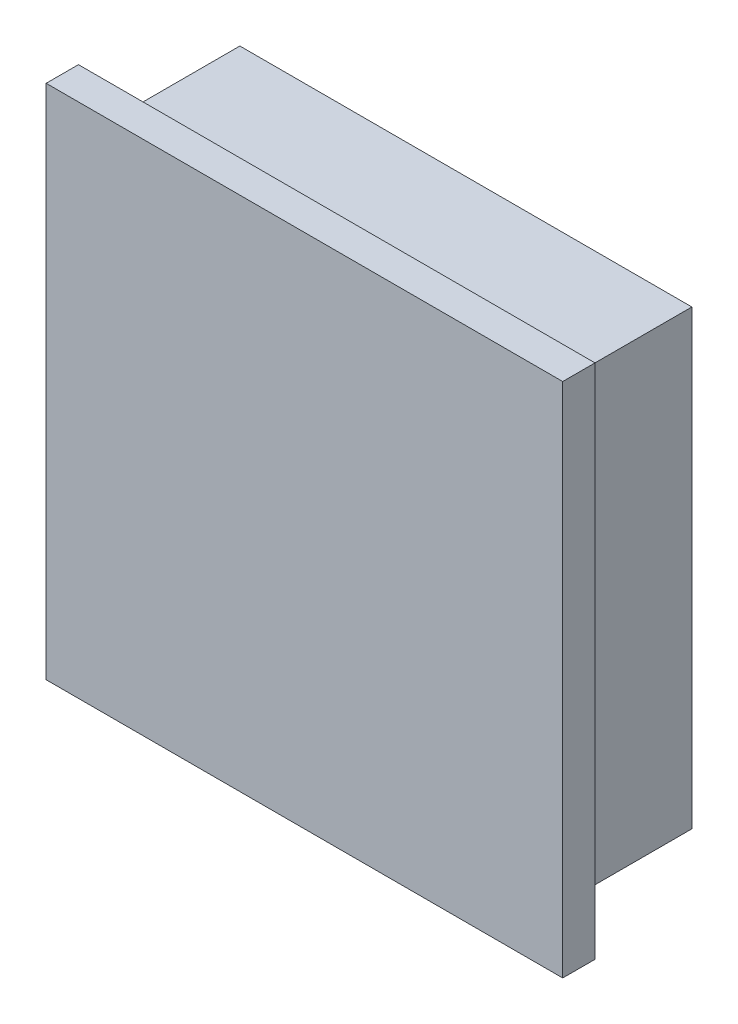
ISO-10303-21;
HEADER;
FILE_DESCRIPTION(('STEP AP214'),'2;1');
FILE_NAME('part.step','',(''),(''),'','','');
FILE_SCHEMA(('AUTOMOTIVE_DESIGN { 1 0 10303 214 1 1 1 1 }'));
ENDSEC;
DATA;
#1=APPLICATION_CONTEXT('core data for automotive mechanical design processes');
#2=APPLICATION_PROTOCOL_DEFINITION('international standard','automotive_design',2000,#1);
#3=PRODUCT_CONTEXT('',#1,'mechanical');
#4=PRODUCT('Part','Part','',(#3));
#5=PRODUCT_RELATED_PRODUCT_CATEGORY('part','',(#4));
#6=PRODUCT_DEFINITION_FORMATION('','',#4);
#7=PRODUCT_DEFINITION_CONTEXT('part definition',#1,'design');
#8=PRODUCT_DEFINITION('design','',#6,#7);
#9=PRODUCT_DEFINITION_SHAPE('','',#8);
#10=(LENGTH_UNIT() NAMED_UNIT(*) SI_UNIT(.MILLI.,.METRE.));
#11=(NAMED_UNIT(*) PLANE_ANGLE_UNIT() SI_UNIT($,.RADIAN.));
#12=(NAMED_UNIT(*) SI_UNIT($,.STERADIAN.) SOLID_ANGLE_UNIT());
#13=UNCERTAINTY_MEASURE_WITH_UNIT(LENGTH_MEASURE(1.E-05),#10,'distance_accuracy_value','');
#14=(GEOMETRIC_REPRESENTATION_CONTEXT(3) GLOBAL_UNCERTAINTY_ASSIGNED_CONTEXT((#13)) GLOBAL_UNIT_ASSIGNED_CONTEXT((#10,
#11,#12)) REPRESENTATION_CONTEXT('',''));
#15=CARTESIAN_POINT('',(0.,0.,0.));
#16=DIRECTION('',(0.,0.,1.));
#17=DIRECTION('',(1.,0.,0.));
#18=AXIS2_PLACEMENT_3D('',#15,#16,#17);
#19=CARTESIAN_POINT('',(0.,-3.175,3.175));
#20=DIRECTION('',(0.,1.,0.));
#21=DIRECTION('',(0.,0.,1.));
#22=AXIS2_PLACEMENT_3D('',#19,#20,#21);
#23=PLANE('',#22);
#24=DIRECTION('',(1.,0.,0.));
#25=VECTOR('',#24,1.);
#26=CARTESIAN_POINT('',(0.,-3.175,0.));
#27=LINE('',#26,#25);
#28=CARTESIAN_POINT('',(-3.175,-3.175,0.));
#29=VERTEX_POINT('',#28);
#30=CARTESIAN_POINT('',(47.625,-3.175,0.));
#31=VERTEX_POINT('',#30);
#32=EDGE_CURVE('E148',#29,#31,#27,.T.);
#33=ORIENTED_EDGE('',*,*,#32,.T.);
#34=DIRECTION('',(0.,0.,-1.));
#35=VECTOR('',#34,1.);
#36=CARTESIAN_POINT('',(47.625,-3.175,3.175));
#37=LINE('',#36,#35);
#38=CARTESIAN_POINT('',(47.625,-3.175,3.175));
#39=VERTEX_POINT('',#38);
#40=EDGE_CURVE('E11',#39,#31,#37,.T.);
#41=ORIENTED_EDGE('',*,*,#40,.F.);
#42=DIRECTION('',(1.,0.,0.));
#43=VECTOR('',#42,1.);
#44=CARTESIAN_POINT('',(0.,-3.175,3.175));
#45=LINE('',#44,#43);
#46=CARTESIAN_POINT('',(-3.175,-3.175,3.175));
#47=VERTEX_POINT('',#46);
#48=EDGE_CURVE('E155',#47,#39,#45,.T.);
#49=ORIENTED_EDGE('',*,*,#48,.F.);
#50=DIRECTION('',(0.,0.,-1.));
#51=VECTOR('',#50,1.);
#52=CARTESIAN_POINT('',(-3.175,-3.175,3.175));
#53=LINE('',#52,#51);
#54=EDGE_CURVE('E171',#47,#29,#53,.T.);
#55=ORIENTED_EDGE('',*,*,#54,.T.);
#56=EDGE_LOOP('',(#33,#41,#49,#55));
#57=FACE_BOUND('',#56,.T.);
#58=ADVANCED_FACE('F41',(#57),#23,.F.);
#59=CARTESIAN_POINT('',(47.625,0.,3.175));
#60=DIRECTION('',(-1.,0.,0.));
#61=DIRECTION('',(0.,0.,1.));
#62=AXIS2_PLACEMENT_3D('',#59,#60,#61);
#63=PLANE('',#62);
#64=DIRECTION('',(0.,1.,0.));
#65=VECTOR('',#64,1.);
#66=CARTESIAN_POINT('',(47.625,0.,0.));
#67=LINE('',#66,#65);
#68=CARTESIAN_POINT('',(47.625,47.625,0.));
#69=VERTEX_POINT('',#68);
#70=EDGE_CURVE('E175',#31,#69,#67,.T.);
#71=ORIENTED_EDGE('',*,*,#70,.T.);
#72=DIRECTION('',(0.,0.,-1.));
#73=VECTOR('',#72,1.);
#74=CARTESIAN_POINT('',(47.625,47.625,3.175));
#75=LINE('',#74,#73);
#76=CARTESIAN_POINT('',(47.625,47.625,3.175));
#77=VERTEX_POINT('',#76);
#78=EDGE_CURVE('E49',#77,#69,#75,.T.);
#79=ORIENTED_EDGE('',*,*,#78,.F.);
#80=DIRECTION('',(0.,1.,0.));
#81=VECTOR('',#80,1.);
#82=CARTESIAN_POINT('',(47.625,0.,3.175));
#83=LINE('',#82,#81);
#84=EDGE_CURVE('E159',#39,#77,#83,.T.);
#85=ORIENTED_EDGE('',*,*,#84,.F.);
#86=ORIENTED_EDGE('',*,*,#40,.T.);
#87=EDGE_LOOP('',(#71,#79,#85,#86));
#88=FACE_BOUND('',#87,.T.);
#89=ADVANCED_FACE('F197',(#88),#63,.F.);
#90=CARTESIAN_POINT('',(0.,47.625,3.175));
#91=DIRECTION('',(0.,1.,0.));
#92=DIRECTION('',(0.,0.,1.));
#93=AXIS2_PLACEMENT_3D('',#90,#91,#92);
#94=PLANE('',#93);
#95=DIRECTION('',(1.,0.,0.));
#96=VECTOR('',#95,1.);
#97=CARTESIAN_POINT('',(0.,47.625,0.));
#98=LINE('',#97,#96);
#99=CARTESIAN_POINT('',(-3.175,47.625,0.));
#100=VERTEX_POINT('',#99);
#101=EDGE_CURVE('E179',#100,#69,#98,.T.);
#102=ORIENTED_EDGE('',*,*,#101,.F.);
#103=DIRECTION('',(0.,0.,-1.));
#104=VECTOR('',#103,1.);
#105=CARTESIAN_POINT('',(-3.175,47.625,3.175));
#106=LINE('',#105,#104);
#107=CARTESIAN_POINT('',(-3.175,47.625,3.175));
#108=VERTEX_POINT('',#107);
#109=EDGE_CURVE('E188',#108,#100,#106,.T.);
#110=ORIENTED_EDGE('',*,*,#109,.F.);
#111=DIRECTION('',(1.,0.,0.));
#112=VECTOR('',#111,1.);
#113=CARTESIAN_POINT('',(0.,47.625,3.175));
#114=LINE('',#113,#112);
#115=EDGE_CURVE('E163',#108,#77,#114,.T.);
#116=ORIENTED_EDGE('',*,*,#115,.T.);
#117=ORIENTED_EDGE('',*,*,#78,.T.);
#118=EDGE_LOOP('',(#102,#110,#116,#117));
#119=FACE_BOUND('',#118,.T.);
#120=ADVANCED_FACE('F194',(#119),#94,.T.);
#121=CARTESIAN_POINT('',(-3.175,0.,3.175));
#122=DIRECTION('',(-1.,0.,0.));
#123=DIRECTION('',(0.,0.,1.));
#124=AXIS2_PLACEMENT_3D('',#121,#122,#123);
#125=PLANE('',#124);
#126=DIRECTION('',(0.,1.,0.));
#127=VECTOR('',#126,1.);
#128=CARTESIAN_POINT('',(-3.175,0.,0.));
#129=LINE('',#128,#127);
#130=EDGE_CURVE('E160',#29,#100,#129,.T.);
#131=ORIENTED_EDGE('',*,*,#130,.F.);
#132=ORIENTED_EDGE('',*,*,#54,.F.);
#133=DIRECTION('',(0.,1.,0.));
#134=VECTOR('',#133,1.);
#135=CARTESIAN_POINT('',(-3.175,0.,3.175));
#136=LINE('',#135,#134);
#137=EDGE_CURVE('E167',#47,#108,#136,.T.);
#138=ORIENTED_EDGE('',*,*,#137,.T.);
#139=ORIENTED_EDGE('',*,*,#109,.T.);
#140=EDGE_LOOP('',(#131,#132,#138,#139));
#141=FACE_BOUND('',#140,.T.);
#142=ADVANCED_FACE('F204',(#141),#125,.T.);
#143=CARTESIAN_POINT('',(0.,0.,3.175));
#144=DIRECTION('',(0.,0.,1.));
#145=DIRECTION('',(1.,0.,0.));
#146=AXIS2_PLACEMENT_3D('',#143,#144,#145);
#147=PLANE('',#146);
#148=ORIENTED_EDGE('',*,*,#48,.T.);
#149=ORIENTED_EDGE('',*,*,#84,.T.);
#150=ORIENTED_EDGE('',*,*,#115,.F.);
#151=ORIENTED_EDGE('',*,*,#137,.F.);
#152=EDGE_LOOP('',(#148,#149,#150,#151));
#153=FACE_BOUND('',#152,.T.);
#154=ADVANCED_FACE('F208',(#153),#147,.T.);
#155=CARTESIAN_POINT('',(0.,0.,0.));
#156=DIRECTION('',(0.,0.,1.));
#157=DIRECTION('',(1.,0.,0.));
#158=AXIS2_PLACEMENT_3D('',#155,#156,#157);
#159=PLANE('',#158);
#160=DIRECTION('',(0.,1.,0.));
#161=VECTOR('',#160,1.);
#162=CARTESIAN_POINT('',(0.,0.,0.));
#163=LINE('',#162,#161);
#164=CARTESIAN_POINT('',(0.,0.,0.));
#165=VERTEX_POINT('',#164);
#166=CARTESIAN_POINT('',(0.,44.45,0.));
#167=VERTEX_POINT('',#166);
#168=EDGE_CURVE('E128',#165,#167,#163,.T.);
#169=ORIENTED_EDGE('',*,*,#168,.F.);
#170=DIRECTION('',(1.,0.,0.));
#171=VECTOR('',#170,1.);
#172=CARTESIAN_POINT('',(0.,0.,0.));
#173=LINE('',#172,#171);
#174=CARTESIAN_POINT('',(44.45,0.,0.));
#175=VERTEX_POINT('',#174);
#176=EDGE_CURVE('E56',#165,#175,#173,.T.);
#177=ORIENTED_EDGE('',*,*,#176,.T.);
#178=DIRECTION('',(0.,1.,0.));
#179=VECTOR('',#178,1.);
#180=CARTESIAN_POINT('',(44.45,0.,0.));
#181=LINE('',#180,#179);
#182=CARTESIAN_POINT('',(44.45,44.45,0.));
#183=VERTEX_POINT('',#182);
#184=EDGE_CURVE('E61',#175,#183,#181,.T.);
#185=ORIENTED_EDGE('',*,*,#184,.T.);
#186=DIRECTION('',(1.,0.,0.));
#187=VECTOR('',#186,1.);
#188=CARTESIAN_POINT('',(0.,44.45,0.));
#189=LINE('',#188,#187);
#190=EDGE_CURVE('E132',#167,#183,#189,.T.);
#191=ORIENTED_EDGE('',*,*,#190,.F.);
#192=EDGE_LOOP('',(#169,#177,#185,#191));
#193=FACE_BOUND('',#192,.T.);
#194=ORIENTED_EDGE('',*,*,#32,.F.);
#195=ORIENTED_EDGE('',*,*,#130,.T.);
#196=ORIENTED_EDGE('',*,*,#101,.T.);
#197=ORIENTED_EDGE('',*,*,#70,.F.);
#198=EDGE_LOOP('',(#194,#195,#196,#197));
#199=FACE_BOUND('',#198,.T.);
#200=ADVANCED_FACE('F201',(#193,#199),#159,.F.);
#201=CARTESIAN_POINT('',(0.,0.,-12.7));
#202=DIRECTION('',(0.,-1.,0.));
#203=DIRECTION('',(0.,0.,-1.));
#204=AXIS2_PLACEMENT_3D('',#201,#202,#203);
#205=PLANE('',#204);
#206=ORIENTED_EDGE('',*,*,#176,.F.);
#207=DIRECTION('',(0.,0.,1.));
#208=VECTOR('',#207,1.);
#209=CARTESIAN_POINT('',(0.,0.,-12.7));
#210=LINE('',#209,#208);
#211=CARTESIAN_POINT('',(0.,0.,-12.7));
#212=VERTEX_POINT('',#211);
#213=EDGE_CURVE('E125',#212,#165,#210,.T.);
#214=ORIENTED_EDGE('',*,*,#213,.F.);
#215=DIRECTION('',(1.,0.,0.));
#216=VECTOR('',#215,1.);
#217=CARTESIAN_POINT('',(0.,0.,-12.7));
#218=LINE('',#217,#216);
#219=CARTESIAN_POINT('',(44.45,0.,-12.7));
#220=VERTEX_POINT('',#219);
#221=EDGE_CURVE('E117',#212,#220,#218,.T.);
#222=ORIENTED_EDGE('',*,*,#221,.T.);
#223=DIRECTION('',(0.,0.,1.));
#224=VECTOR('',#223,1.);
#225=CARTESIAN_POINT('',(44.45,0.,-12.7));
#226=LINE('',#225,#224);
#227=EDGE_CURVE('E104',#220,#175,#226,.T.);
#228=ORIENTED_EDGE('',*,*,#227,.T.);
#229=EDGE_LOOP('',(#206,#214,#222,#228));
#230=FACE_BOUND('',#229,.T.);
#231=ADVANCED_FACE('F123',(#230),#205,.T.);
#232=CARTESIAN_POINT('',(0.,0.,-12.7));
#233=DIRECTION('',(1.,0.,0.));
#234=DIRECTION('',(0.,0.,-1.));
#235=AXIS2_PLACEMENT_3D('',#232,#233,#234);
#236=PLANE('',#235);
#237=ORIENTED_EDGE('',*,*,#168,.T.);
#238=DIRECTION('',(0.,0.,1.));
#239=VECTOR('',#238,1.);
#240=CARTESIAN_POINT('',(0.,44.45,-12.7));
#241=LINE('',#240,#239);
#242=CARTESIAN_POINT('',(0.,44.45,-12.7));
#243=VERTEX_POINT('',#242);
#244=EDGE_CURVE('E149',#243,#167,#241,.T.);
#245=ORIENTED_EDGE('',*,*,#244,.F.);
#246=DIRECTION('',(0.,1.,0.));
#247=VECTOR('',#246,1.);
#248=CARTESIAN_POINT('',(0.,0.,-12.7));
#249=LINE('',#248,#247);
#250=EDGE_CURVE('E112',#212,#243,#249,.T.);
#251=ORIENTED_EDGE('',*,*,#250,.F.);
#252=ORIENTED_EDGE('',*,*,#213,.T.);
#253=EDGE_LOOP('',(#237,#245,#251,#252));
#254=FACE_BOUND('',#253,.T.);
#255=ADVANCED_FACE('F227',(#254),#236,.F.);
#256=CARTESIAN_POINT('',(0.,44.45,-12.7));
#257=DIRECTION('',(0.,-1.,0.));
#258=DIRECTION('',(0.,0.,-1.));
#259=AXIS2_PLACEMENT_3D('',#256,#257,#258);
#260=PLANE('',#259);
#261=ORIENTED_EDGE('',*,*,#190,.T.);
#262=DIRECTION('',(0.,0.,1.));
#263=VECTOR('',#262,1.);
#264=CARTESIAN_POINT('',(44.45,44.45,-12.7));
#265=LINE('',#264,#263);
#266=CARTESIAN_POINT('',(44.45,44.45,-12.7));
#267=VERTEX_POINT('',#266);
#268=EDGE_CURVE('E111',#267,#183,#265,.T.);
#269=ORIENTED_EDGE('',*,*,#268,.F.);
#270=DIRECTION('',(1.,0.,0.));
#271=VECTOR('',#270,1.);
#272=CARTESIAN_POINT('',(0.,44.45,-12.7));
#273=LINE('',#272,#271);
#274=EDGE_CURVE('E119',#243,#267,#273,.T.);
#275=ORIENTED_EDGE('',*,*,#274,.F.);
#276=ORIENTED_EDGE('',*,*,#244,.T.);
#277=EDGE_LOOP('',(#261,#269,#275,#276));
#278=FACE_BOUND('',#277,.T.);
#279=ADVANCED_FACE('F230',(#278),#260,.F.);
#280=CARTESIAN_POINT('',(44.45,0.,-12.7));
#281=DIRECTION('',(1.,0.,0.));
#282=DIRECTION('',(0.,0.,-1.));
#283=AXIS2_PLACEMENT_3D('',#280,#281,#282);
#284=PLANE('',#283);
#285=ORIENTED_EDGE('',*,*,#184,.F.);
#286=ORIENTED_EDGE('',*,*,#227,.F.);
#287=DIRECTION('',(0.,1.,0.));
#288=VECTOR('',#287,1.);
#289=CARTESIAN_POINT('',(44.45,0.,-12.7));
#290=LINE('',#289,#288);
#291=EDGE_CURVE('E107',#220,#267,#290,.T.);
#292=ORIENTED_EDGE('',*,*,#291,.T.);
#293=ORIENTED_EDGE('',*,*,#268,.T.);
#294=EDGE_LOOP('',(#285,#286,#292,#293));
#295=FACE_BOUND('',#294,.T.);
#296=ADVANCED_FACE('F106',(#295),#284,.T.);
#297=CARTESIAN_POINT('',(0.,0.,-12.7));
#298=DIRECTION('',(0.,0.,1.));
#299=DIRECTION('',(1.,0.,0.));
#300=AXIS2_PLACEMENT_3D('',#297,#298,#299);
#301=PLANE('',#300);
#302=ORIENTED_EDGE('',*,*,#221,.F.);
#303=ORIENTED_EDGE('',*,*,#250,.T.);
#304=ORIENTED_EDGE('',*,*,#274,.T.);
#305=ORIENTED_EDGE('',*,*,#291,.F.);
#306=EDGE_LOOP('',(#302,#303,#304,#305));
#307=FACE_BOUND('',#306,.T.);
#308=ADVANCED_FACE('F116',(#307),#301,.F.);
#309=CLOSED_SHELL('',(#58,#89,#120,#142,#154,#200,#231,#255,#279,#296,#308));
#310=MANIFOLD_SOLID_BREP('B2',#309);
#311=ADVANCED_BREP_SHAPE_REPRESENTATION('',(#18,#310),#14);
#312=SHAPE_DEFINITION_REPRESENTATION(#9,#311);
ENDSEC;
END-ISO-10303-21;
